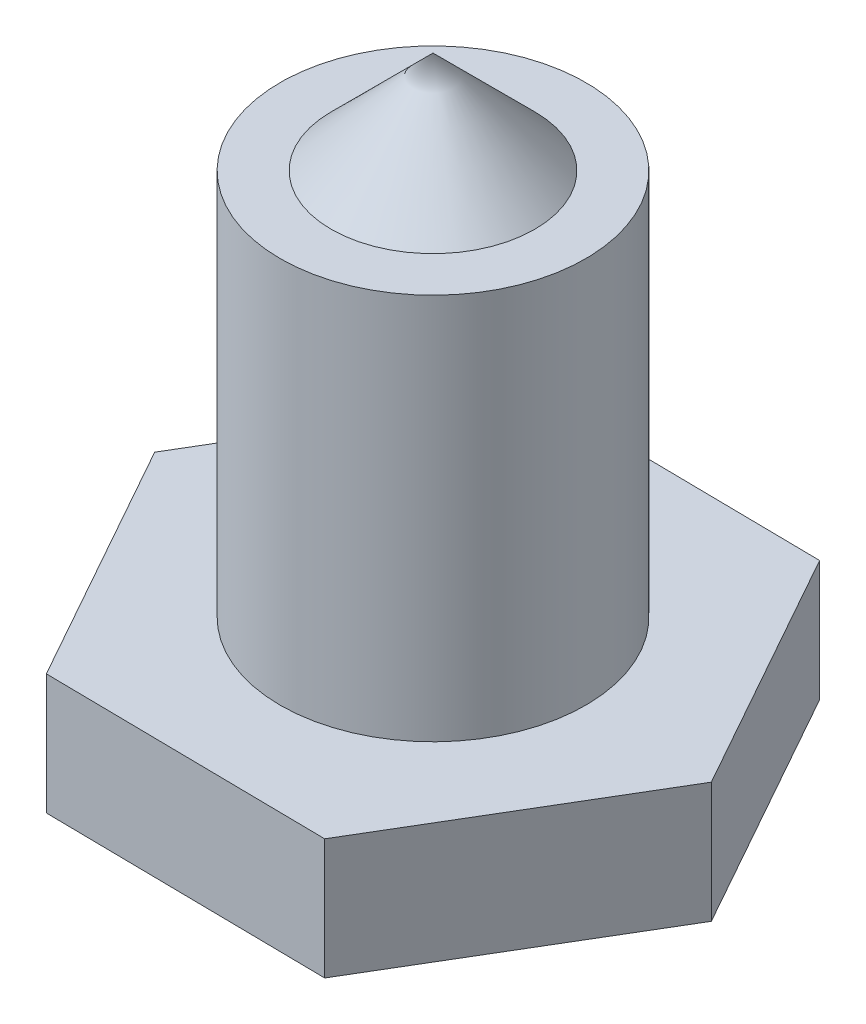
ISO-10303-21;
HEADER;
FILE_DESCRIPTION(('STEP AP214'),'2;1');
FILE_NAME('part.step','',(''),(''),'','','');
FILE_SCHEMA(('AUTOMOTIVE_DESIGN { 1 0 10303 214 1 1 1 1 }'));
ENDSEC;
DATA;
#1=APPLICATION_CONTEXT('core data for automotive mechanical design processes');
#2=APPLICATION_PROTOCOL_DEFINITION('international standard','automotive_design',2000,#1);
#3=PRODUCT_CONTEXT('',#1,'mechanical');
#4=PRODUCT('Part','Part','',(#3));
#5=PRODUCT_RELATED_PRODUCT_CATEGORY('part','',(#4));
#6=PRODUCT_DEFINITION_FORMATION('','',#4);
#7=PRODUCT_DEFINITION_CONTEXT('part definition',#1,'design');
#8=PRODUCT_DEFINITION('design','',#6,#7);
#9=PRODUCT_DEFINITION_SHAPE('','',#8);
#10=(LENGTH_UNIT() NAMED_UNIT(*) SI_UNIT(.MILLI.,.METRE.));
#11=(NAMED_UNIT(*) PLANE_ANGLE_UNIT() SI_UNIT($,.RADIAN.));
#12=(NAMED_UNIT(*) SI_UNIT($,.STERADIAN.) SOLID_ANGLE_UNIT());
#13=UNCERTAINTY_MEASURE_WITH_UNIT(LENGTH_MEASURE(1.E-05),#10,'distance_accuracy_value','');
#14=(GEOMETRIC_REPRESENTATION_CONTEXT(3) GLOBAL_UNCERTAINTY_ASSIGNED_CONTEXT((#13)) GLOBAL_UNIT_ASSIGNED_CONTEXT((#10,
#11,#12)) REPRESENTATION_CONTEXT('',''));
#15=CARTESIAN_POINT('',(0.,0.,0.));
#16=DIRECTION('',(0.,0.,1.));
#17=DIRECTION('',(1.,0.,0.));
#18=AXIS2_PLACEMENT_3D('',#15,#16,#17);
#19=CARTESIAN_POINT('',(10.997565326129,4.7,0.145109949783447));
#20=DIRECTION('',(-0.872546818480198,0.,0.488530500132882));
#21=DIRECTION('',(0.488530500132882,0.,0.872546818480198));
#22=AXIS2_PLACEMENT_3D('',#19,#20,#21);
#23=PLANE('',#22);
#24=DIRECTION('',(-0.488530500132882,0.,-0.872546818480198));
#25=VECTOR('',#24,1.);
#26=CARTESIAN_POINT('',(10.997565326129,0.,0.145109949783447));
#27=LINE('',#26,#25);
#28=CARTESIAN_POINT('',(10.997565326129,0.,0.145109949783447));
#29=VERTEX_POINT('',#28);
#30=CARTESIAN_POINT('',(5.62445156591883,0.,-9.45161597731485));
#31=VERTEX_POINT('',#30);
#32=EDGE_CURVE('E124',#29,#31,#27,.T.);
#33=ORIENTED_EDGE('',*,*,#32,.T.);
#34=DIRECTION('',(0.,-1.,0.));
#35=VECTOR('',#34,1.);
#36=CARTESIAN_POINT('',(5.62445156591883,4.7,-9.45161597731485));
#37=LINE('',#36,#35);
#38=CARTESIAN_POINT('',(5.62445156591883,4.7,-9.45161597731485));
#39=VERTEX_POINT('',#38);
#40=EDGE_CURVE('E45',#39,#31,#37,.T.);
#41=ORIENTED_EDGE('',*,*,#40,.F.);
#42=DIRECTION('',(-0.488530500132882,0.,-0.872546818480198));
#43=VECTOR('',#42,1.);
#44=CARTESIAN_POINT('',(10.997565326129,4.7,0.145109949783447));
#45=LINE('',#44,#43);
#46=CARTESIAN_POINT('',(10.997565326129,4.7,0.145109949783447));
#47=VERTEX_POINT('',#46);
#48=EDGE_CURVE('E135',#47,#39,#45,.T.);
#49=ORIENTED_EDGE('',*,*,#48,.F.);
#50=DIRECTION('',(0.,-1.,0.));
#51=VECTOR('',#50,1.);
#52=CARTESIAN_POINT('',(10.997565326129,4.7,0.145109949783447));
#53=LINE('',#52,#51);
#54=EDGE_CURVE('E120',#47,#29,#53,.T.);
#55=ORIENTED_EDGE('',*,*,#54,.T.);
#56=EDGE_LOOP('',(#33,#41,#49,#55));
#57=FACE_BOUND('',#56,.T.);
#58=ADVANCED_FACE('F37',(#57),#23,.F.);
#59=CARTESIAN_POINT('',(5.62445156591883,4.7,-9.45161597731485));
#60=DIRECTION('',(-0.0131935856015067,0.,0.999912960861582));
#61=DIRECTION('',(0.999912960861582,0.,0.0131935856015067));
#62=AXIS2_PLACEMENT_3D('',#59,#60,#61);
#63=PLANE('',#62);
#64=DIRECTION('',(-0.999912960861582,0.,-0.0131935856015067));
#65=VECTOR('',#64,1.);
#66=CARTESIAN_POINT('',(5.62445156591883,0.,-9.45161597731485));
#67=LINE('',#66,#65);
#68=CARTESIAN_POINT('',(-5.37311376021013,0.,-9.59672592709829));
#69=VERTEX_POINT('',#68);
#70=EDGE_CURVE('E127',#31,#69,#67,.T.);
#71=ORIENTED_EDGE('',*,*,#70,.T.);
#72=DIRECTION('',(0.,-1.,0.));
#73=VECTOR('',#72,1.);
#74=CARTESIAN_POINT('',(-5.37311376021013,4.7,-9.59672592709829));
#75=LINE('',#74,#73);
#76=CARTESIAN_POINT('',(-5.37311376021013,4.7,-9.59672592709829));
#77=VERTEX_POINT('',#76);
#78=EDGE_CURVE('E139',#77,#69,#75,.T.);
#79=ORIENTED_EDGE('',*,*,#78,.F.);
#80=DIRECTION('',(-0.999912960861582,0.,-0.0131935856015067));
#81=VECTOR('',#80,1.);
#82=CARTESIAN_POINT('',(5.62445156591883,4.7,-9.45161597731485));
#83=LINE('',#82,#81);
#84=EDGE_CURVE('E92',#39,#77,#83,.T.);
#85=ORIENTED_EDGE('',*,*,#84,.F.);
#86=ORIENTED_EDGE('',*,*,#40,.T.);
#87=EDGE_LOOP('',(#71,#79,#85,#86));
#88=FACE_BOUND('',#87,.T.);
#89=ADVANCED_FACE('F142',(#88),#63,.F.);
#90=CARTESIAN_POINT('',(-5.37311376021013,4.7,-9.59672592709829));
#91=DIRECTION('',(0.859353232878692,0.,0.5113824607287));
#92=DIRECTION('',(0.5113824607287,0.,-0.859353232878692));
#93=AXIS2_PLACEMENT_3D('',#90,#91,#92);
#94=PLANE('',#93);
#95=DIRECTION('',(-0.5113824607287,0.,0.859353232878692));
#96=VECTOR('',#95,1.);
#97=CARTESIAN_POINT('',(-5.37311376021013,0.,-9.59672592709829));
#98=LINE('',#97,#96);
#99=CARTESIAN_POINT('',(-10.997565326129,0.,-0.145109949783442));
#100=VERTEX_POINT('',#99);
#101=EDGE_CURVE('E130',#69,#100,#98,.T.);
#102=ORIENTED_EDGE('',*,*,#101,.T.);
#103=DIRECTION('',(0.,-1.,0.));
#104=VECTOR('',#103,1.);
#105=CARTESIAN_POINT('',(-10.997565326129,4.7,-0.145109949783442));
#106=LINE('',#105,#104);
#107=CARTESIAN_POINT('',(-10.997565326129,4.7,-0.145109949783442));
#108=VERTEX_POINT('',#107);
#109=EDGE_CURVE('E115',#108,#100,#106,.T.);
#110=ORIENTED_EDGE('',*,*,#109,.F.);
#111=DIRECTION('',(-0.5113824607287,0.,0.859353232878692));
#112=VECTOR('',#111,1.);
#113=CARTESIAN_POINT('',(-5.37311376021013,4.7,-9.59672592709829));
#114=LINE('',#113,#112);
#115=EDGE_CURVE('E106',#77,#108,#114,.T.);
#116=ORIENTED_EDGE('',*,*,#115,.F.);
#117=ORIENTED_EDGE('',*,*,#78,.T.);
#118=EDGE_LOOP('',(#102,#110,#116,#117));
#119=FACE_BOUND('',#118,.T.);
#120=ADVANCED_FACE('F150',(#119),#94,.F.);
#121=CARTESIAN_POINT('',(-10.997565326129,4.7,-0.145109949783442));
#122=DIRECTION('',(0.872546818480198,0.,-0.488530500132882));
#123=DIRECTION('',(-0.488530500132882,0.,-0.872546818480198));
#124=AXIS2_PLACEMENT_3D('',#121,#122,#123);
#125=PLANE('',#124);
#126=DIRECTION('',(0.488530500132882,0.,0.872546818480198));
#127=VECTOR('',#126,1.);
#128=CARTESIAN_POINT('',(-10.997565326129,0.,-0.145109949783442));
#129=LINE('',#128,#127);
#130=CARTESIAN_POINT('',(-5.62445156591882,0.,9.45161597731485));
#131=VERTEX_POINT('',#130);
#132=EDGE_CURVE('E114',#100,#131,#129,.T.);
#133=ORIENTED_EDGE('',*,*,#132,.T.);
#134=DIRECTION('',(0.,-1.,0.));
#135=VECTOR('',#134,1.);
#136=CARTESIAN_POINT('',(-5.62445156591882,4.7,9.45161597731485));
#137=LINE('',#136,#135);
#138=CARTESIAN_POINT('',(-5.62445156591882,4.7,9.45161597731485));
#139=VERTEX_POINT('',#138);
#140=EDGE_CURVE('E111',#139,#131,#137,.T.);
#141=ORIENTED_EDGE('',*,*,#140,.F.);
#142=DIRECTION('',(0.488530500132882,0.,0.872546818480198));
#143=VECTOR('',#142,1.);
#144=CARTESIAN_POINT('',(-10.997565326129,4.7,-0.145109949783442));
#145=LINE('',#144,#143);
#146=EDGE_CURVE('E100',#108,#139,#145,.T.);
#147=ORIENTED_EDGE('',*,*,#146,.F.);
#148=ORIENTED_EDGE('',*,*,#109,.T.);
#149=EDGE_LOOP('',(#133,#141,#147,#148));
#150=FACE_BOUND('',#149,.T.);
#151=ADVANCED_FACE('F112',(#150),#125,.F.);
#152=CARTESIAN_POINT('',(-5.62445156591882,4.7,9.45161597731485));
#153=DIRECTION('',(0.0131935856015065,0.,-0.999912960861582));
#154=DIRECTION('',(-0.999912960861582,0.,-0.0131935856015065));
#155=AXIS2_PLACEMENT_3D('',#152,#153,#154);
#156=PLANE('',#155);
#157=DIRECTION('',(0.999912960861582,0.,0.0131935856015065));
#158=VECTOR('',#157,1.);
#159=CARTESIAN_POINT('',(-5.62445156591882,0.,9.45161597731485));
#160=LINE('',#159,#158);
#161=CARTESIAN_POINT('',(5.37311376021013,0.,9.59672592709829));
#162=VERTEX_POINT('',#161);
#163=EDGE_CURVE('E77',#131,#162,#160,.T.);
#164=ORIENTED_EDGE('',*,*,#163,.T.);
#165=DIRECTION('',(0.,-1.,0.));
#166=VECTOR('',#165,1.);
#167=CARTESIAN_POINT('',(5.37311376021013,4.7,9.59672592709829));
#168=LINE('',#167,#166);
#169=CARTESIAN_POINT('',(5.37311376021013,4.7,9.59672592709829));
#170=VERTEX_POINT('',#169);
#171=EDGE_CURVE('E116',#170,#162,#168,.T.);
#172=ORIENTED_EDGE('',*,*,#171,.F.);
#173=DIRECTION('',(0.999912960861582,0.,0.0131935856015065));
#174=VECTOR('',#173,1.);
#175=CARTESIAN_POINT('',(-5.62445156591882,4.7,9.45161597731485));
#176=LINE('',#175,#174);
#177=EDGE_CURVE('E104',#139,#170,#176,.T.);
#178=ORIENTED_EDGE('',*,*,#177,.F.);
#179=ORIENTED_EDGE('',*,*,#140,.T.);
#180=EDGE_LOOP('',(#164,#172,#178,#179));
#181=FACE_BOUND('',#180,.T.);
#182=ADVANCED_FACE('F118',(#181),#156,.F.);
#183=CARTESIAN_POINT('',(5.37311376021013,4.7,9.59672592709829));
#184=DIRECTION('',(-0.859353232878692,0.,-0.5113824607287));
#185=DIRECTION('',(-0.5113824607287,0.,0.859353232878692));
#186=AXIS2_PLACEMENT_3D('',#183,#184,#185);
#187=PLANE('',#186);
#188=DIRECTION('',(0.5113824607287,0.,-0.859353232878692));
#189=VECTOR('',#188,1.);
#190=CARTESIAN_POINT('',(5.37311376021013,0.,9.59672592709829));
#191=LINE('',#190,#189);
#192=EDGE_CURVE('E83',#162,#29,#191,.T.);
#193=ORIENTED_EDGE('',*,*,#192,.T.);
#194=ORIENTED_EDGE('',*,*,#54,.F.);
#195=DIRECTION('',(0.5113824607287,0.,-0.859353232878692));
#196=VECTOR('',#195,1.);
#197=CARTESIAN_POINT('',(5.37311376021013,4.7,9.59672592709829));
#198=LINE('',#197,#196);
#199=EDGE_CURVE('E53',#170,#47,#198,.T.);
#200=ORIENTED_EDGE('',*,*,#199,.F.);
#201=ORIENTED_EDGE('',*,*,#171,.T.);
#202=EDGE_LOOP('',(#193,#194,#200,#201));
#203=FACE_BOUND('',#202,.T.);
#204=ADVANCED_FACE('F169',(#203),#187,.F.);
#205=CARTESIAN_POINT('',(0.,4.7,0.));
#206=DIRECTION('',(0.,1.,0.));
#207=DIRECTION('',(0.,0.,1.));
#208=AXIS2_PLACEMENT_3D('',#205,#206,#207);
#209=PLANE('',#208);
#210=CARTESIAN_POINT('',(0.,4.7,0.));
#211=DIRECTION('',(0.,1.,0.));
#212=DIRECTION('',(0.,0.,1.));
#213=AXIS2_PLACEMENT_3D('',#210,#211,#212);
#214=CIRCLE('',#213,5.953125);
#215=CARTESIAN_POINT('',(0.,4.7,5.953125));
#216=VERTEX_POINT('',#215);
#217=EDGE_CURVE('E154',#216,#216,#214,.T.);
#218=ORIENTED_EDGE('',*,*,#217,.F.);
#219=EDGE_LOOP('',(#218));
#220=FACE_BOUND('',#219,.T.);
#221=ORIENTED_EDGE('',*,*,#48,.T.);
#222=ORIENTED_EDGE('',*,*,#84,.T.);
#223=ORIENTED_EDGE('',*,*,#115,.T.);
#224=ORIENTED_EDGE('',*,*,#146,.T.);
#225=ORIENTED_EDGE('',*,*,#177,.T.);
#226=ORIENTED_EDGE('',*,*,#199,.T.);
#227=EDGE_LOOP('',(#221,#222,#223,#224,#225,#226));
#228=FACE_BOUND('',#227,.T.);
#229=ADVANCED_FACE('F102',(#220,#228),#209,.T.);
#230=CARTESIAN_POINT('',(0.,0.,0.));
#231=DIRECTION('',(0.,1.,0.));
#232=DIRECTION('',(0.,0.,1.));
#233=AXIS2_PLACEMENT_3D('',#230,#231,#232);
#234=PLANE('',#233);
#235=ORIENTED_EDGE('',*,*,#32,.F.);
#236=ORIENTED_EDGE('',*,*,#192,.F.);
#237=ORIENTED_EDGE('',*,*,#163,.F.);
#238=ORIENTED_EDGE('',*,*,#132,.F.);
#239=ORIENTED_EDGE('',*,*,#101,.F.);
#240=ORIENTED_EDGE('',*,*,#70,.F.);
#241=EDGE_LOOP('',(#235,#236,#237,#238,#239,#240));
#242=FACE_BOUND('',#241,.T.);
#243=ADVANCED_FACE('F147',(#242),#234,.F.);
#244=CARTESIAN_POINT('',(0.,19.78125,0.));
#245=DIRECTION('',(0.,-1.,0.));
#246=DIRECTION('',(0.,0.,-1.));
#247=AXIS2_PLACEMENT_3D('',#244,#245,#246);
#248=CYLINDRICAL_SURFACE('',#247,5.953125);
#249=CARTESIAN_POINT('',(0.,19.78125,0.));
#250=DIRECTION('',(0.,1.,0.));
#251=DIRECTION('',(0.,0.,1.));
#252=AXIS2_PLACEMENT_3D('',#249,#250,#251);
#253=CIRCLE('',#252,5.953125);
#254=CARTESIAN_POINT('',(0.,19.78125,5.953125));
#255=VERTEX_POINT('',#254);
#256=EDGE_CURVE('E128',#255,#255,#253,.T.);
#257=ORIENTED_EDGE('',*,*,#256,.F.);
#258=EDGE_LOOP('',(#257));
#259=FACE_BOUND('',#258,.T.);
#260=ORIENTED_EDGE('',*,*,#217,.T.);
#261=EDGE_LOOP('',(#260));
#262=FACE_BOUND('',#261,.T.);
#263=ADVANCED_FACE('F162',(#259,#262),#248,.T.);
#264=CARTESIAN_POINT('',(0.,19.78125,0.));
#265=DIRECTION('',(0.,1.,0.));
#266=DIRECTION('',(0.,0.,1.));
#267=AXIS2_PLACEMENT_3D('',#264,#265,#266);
#268=PLANE('',#267);
#269=CARTESIAN_POINT('',(0.,19.78125,0.));
#270=DIRECTION('',(0.,1.,0.));
#271=DIRECTION('',(0.,0.,1.));
#272=AXIS2_PLACEMENT_3D('',#269,#270,#271);
#273=CIRCLE('',#272,3.96875);
#274=CARTESIAN_POINT('',(0.,19.78125,3.96875));
#275=VERTEX_POINT('',#274);
#276=EDGE_CURVE('E11',#275,#275,#273,.T.);
#277=ORIENTED_EDGE('',*,*,#276,.F.);
#278=EDGE_LOOP('',(#277));
#279=FACE_BOUND('',#278,.T.);
#280=ORIENTED_EDGE('',*,*,#256,.T.);
#281=EDGE_LOOP('',(#280));
#282=FACE_BOUND('',#281,.T.);
#283=ADVANCED_FACE('F160',(#279,#282),#268,.T.);
#284=CARTESIAN_POINT('',(0.,19.78125,0.));
#285=DIRECTION('',(0.,-1.,0.));
#286=DIRECTION('',(0.,0.,-1.));
#287=AXIS2_PLACEMENT_3D('',#284,#285,#286);
#288=CONICAL_SURFACE('',#287,3.96875,0.785398163397448);
#289=CARTESIAN_POINT('',(0.,23.75,0.));
#290=VERTEX_POINT('',#289);
#291=VERTEX_LOOP('',#290);
#292=FACE_BOUND('',#291,.T.);
#293=ORIENTED_EDGE('',*,*,#276,.T.);
#294=EDGE_LOOP('',(#293));
#295=FACE_BOUND('',#294,.T.);
#296=ADVANCED_FACE('F221',(#292,#295),#288,.T.);
#297=CLOSED_SHELL('',(#58,#89,#120,#151,#182,#204,#229,#243,#263,#283,#296));
#298=MANIFOLD_SOLID_BREP('B2',#297);
#299=ADVANCED_BREP_SHAPE_REPRESENTATION('',(#18,#298),#14);
#300=SHAPE_DEFINITION_REPRESENTATION(#9,#299);
ENDSEC;
END-ISO-10303-21;
